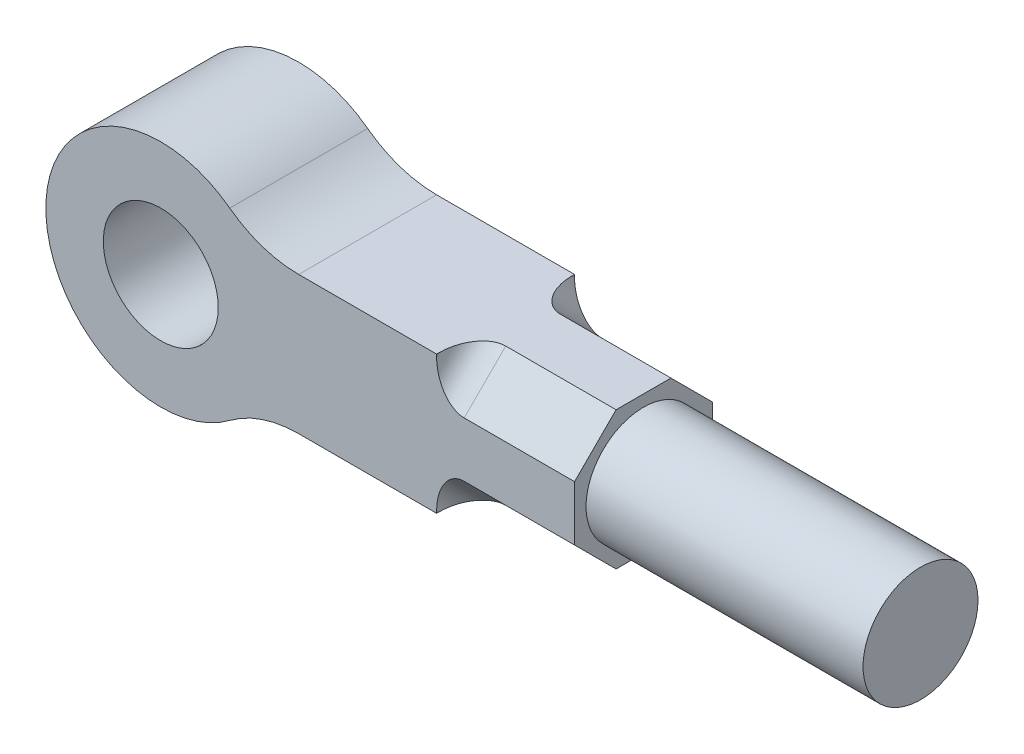
ISO-10303-21;
HEADER;
FILE_DESCRIPTION(('STEP AP214'),'2;1');
FILE_NAME('part.step','',(''),(''),'','','');
FILE_SCHEMA(('AUTOMOTIVE_DESIGN { 1 0 10303 214 1 1 1 1 }'));
ENDSEC;
DATA;
#1=APPLICATION_CONTEXT('core data for automotive mechanical design processes');
#2=APPLICATION_PROTOCOL_DEFINITION('international standard','automotive_design',2000,#1);
#3=PRODUCT_CONTEXT('',#1,'mechanical');
#4=PRODUCT('Part','Part','',(#3));
#5=PRODUCT_RELATED_PRODUCT_CATEGORY('part','',(#4));
#6=PRODUCT_DEFINITION_FORMATION('','',#4);
#7=PRODUCT_DEFINITION_CONTEXT('part definition',#1,'design');
#8=PRODUCT_DEFINITION('design','',#6,#7);
#9=PRODUCT_DEFINITION_SHAPE('','',#8);
#10=(LENGTH_UNIT() NAMED_UNIT(*) SI_UNIT(.MILLI.,.METRE.));
#11=(NAMED_UNIT(*) PLANE_ANGLE_UNIT() SI_UNIT($,.RADIAN.));
#12=(NAMED_UNIT(*) SI_UNIT($,.STERADIAN.) SOLID_ANGLE_UNIT());
#13=UNCERTAINTY_MEASURE_WITH_UNIT(LENGTH_MEASURE(1.E-05),#10,'distance_accuracy_value','');
#14=(GEOMETRIC_REPRESENTATION_CONTEXT(3) GLOBAL_UNCERTAINTY_ASSIGNED_CONTEXT((#13)) GLOBAL_UNIT_ASSIGNED_CONTEXT((#10,
#11,#12)) REPRESENTATION_CONTEXT('',''));
#15=CARTESIAN_POINT('',(0.,0.,0.));
#16=DIRECTION('',(0.,0.,1.));
#17=DIRECTION('',(1.,0.,0.));
#18=AXIS2_PLACEMENT_3D('',#15,#16,#17);
#19=CARTESIAN_POINT('',(600.,-800.,600.));
#20=DIRECTION('',(0.,0.,-1.));
#21=DIRECTION('',(-1.,0.,0.));
#22=AXIS2_PLACEMENT_3D('',#19,#20,#21);
#23=PLANE('',#22);
#24=DIRECTION('',(0.,-1.,0.));
#25=VECTOR('',#24,1.);
#26=CARTESIAN_POINT('',(1200.,0.,600.));
#27=LINE('',#26,#25);
#28=CARTESIAN_POINT('',(1200.,-289.105627484766,600.));
#29=VERTEX_POINT('',#28);
#30=CARTESIAN_POINT('',(1200.,-300.,600.));
#31=VERTEX_POINT('',#30);
#32=EDGE_CURVE('E294',#29,#31,#27,.T.);
#33=ORIENTED_EDGE('',*,*,#32,.F.);
#34=CARTESIAN_POINT('',(1320.,-289.105627484766,600.));
#35=DIRECTION('',(0.,0.,-1.));
#36=DIRECTION('',(0.,1.,0.));
#37=AXIS2_PLACEMENT_3D('',#34,#35,#36);
#38=ELLIPSE('',#37,169.705627484773,120.);
#39=CARTESIAN_POINT('',(1320.,-119.399999999994,600.));
#40=VERTEX_POINT('',#39);
#41=EDGE_CURVE('E251',#29,#40,#38,.T.);
#42=ORIENTED_EDGE('',*,*,#41,.T.);
#43=DIRECTION('',(1.,0.,0.));
#44=VECTOR('',#43,1.);
#45=CARTESIAN_POINT('',(1200.,-119.399999999994,600.));
#46=LINE('',#45,#44);
#47=CARTESIAN_POINT('',(1800.,-119.399999999994,600.));
#48=VERTEX_POINT('',#47);
#49=EDGE_CURVE('E285',#40,#48,#46,.T.);
#50=ORIENTED_EDGE('',*,*,#49,.T.);
#51=DIRECTION('',(0.,1.,0.));
#52=VECTOR('',#51,1.);
#53=CARTESIAN_POINT('',(1800.,300.,600.));
#54=LINE('',#53,#52);
#55=CARTESIAN_POINT('',(1800.,119.399999999993,600.));
#56=VERTEX_POINT('',#55);
#57=EDGE_CURVE('E338',#48,#56,#54,.T.);
#58=ORIENTED_EDGE('',*,*,#57,.T.);
#59=DIRECTION('',(1.,0.,0.));
#60=VECTOR('',#59,1.);
#61=CARTESIAN_POINT('',(1200.,119.399999999993,600.));
#62=LINE('',#61,#60);
#63=CARTESIAN_POINT('',(1320.,119.399999999993,600.));
#64=VERTEX_POINT('',#63);
#65=EDGE_CURVE('E313',#64,#56,#62,.T.);
#66=ORIENTED_EDGE('',*,*,#65,.F.);
#67=CARTESIAN_POINT('',(1320.,289.105627484763,600.));
#68=DIRECTION('',(0.,0.,-1.));
#69=DIRECTION('',(0.,1.,0.));
#70=AXIS2_PLACEMENT_3D('',#67,#68,#69);
#71=ELLIPSE('',#70,169.70562748477,120.);
#72=CARTESIAN_POINT('',(1200.,289.105627484763,600.));
#73=VERTEX_POINT('',#72);
#74=EDGE_CURVE('E11',#64,#73,#71,.T.);
#75=ORIENTED_EDGE('',*,*,#74,.T.);
#76=DIRECTION('',(0.,-1.,0.));
#77=VECTOR('',#76,1.);
#78=CARTESIAN_POINT('',(1200.,0.,600.));
#79=LINE('',#78,#77);
#80=CARTESIAN_POINT('',(1200.,300.,600.));
#81=VERTEX_POINT('',#80);
#82=EDGE_CURVE('E306',#81,#73,#79,.T.);
#83=ORIENTED_EDGE('',*,*,#82,.F.);
#84=DIRECTION('',(-1.,0.,0.));
#85=VECTOR('',#84,1.);
#86=CARTESIAN_POINT('',(600.,300.,600.));
#87=LINE('',#86,#85);
#88=CARTESIAN_POINT('',(600.,300.,600.));
#89=VERTEX_POINT('',#88);
#90=EDGE_CURVE('E342',#81,#89,#87,.T.);
#91=ORIENTED_EDGE('',*,*,#90,.T.);
#92=CARTESIAN_POINT('',(600.,800.,600.));
#93=DIRECTION('',(0.,0.,-1.));
#94=DIRECTION('',(1.,0.,0.));
#95=AXIS2_PLACEMENT_3D('',#92,#93,#94);
#96=CIRCLE('',#95,500.);
#97=CARTESIAN_POINT('',(300.,400.,600.));
#98=VERTEX_POINT('',#97);
#99=EDGE_CURVE('E345',#89,#98,#96,.T.);
#100=ORIENTED_EDGE('',*,*,#99,.T.);
#101=CARTESIAN_POINT('',(0.,0.,600.));
#102=DIRECTION('',(0.,0.,1.));
#103=DIRECTION('',(1.,0.,0.));
#104=AXIS2_PLACEMENT_3D('',#101,#102,#103);
#105=CIRCLE('',#104,500.);
#106=CARTESIAN_POINT('',(300.,-400.,600.));
#107=VERTEX_POINT('',#106);
#108=EDGE_CURVE('E348',#98,#107,#105,.T.);
#109=ORIENTED_EDGE('',*,*,#108,.T.);
#110=CARTESIAN_POINT('',(600.,-800.,600.));
#111=DIRECTION('',(0.,0.,-1.));
#112=DIRECTION('',(-1.,0.,0.));
#113=AXIS2_PLACEMENT_3D('',#110,#111,#112);
#114=CIRCLE('',#113,500.);
#115=CARTESIAN_POINT('',(600.,-300.,600.));
#116=VERTEX_POINT('',#115);
#117=EDGE_CURVE('E329',#107,#116,#114,.T.);
#118=ORIENTED_EDGE('',*,*,#117,.T.);
#119=DIRECTION('',(1.,0.,0.));
#120=VECTOR('',#119,1.);
#121=CARTESIAN_POINT('',(600.,-300.,600.));
#122=LINE('',#121,#120);
#123=EDGE_CURVE('E333',#116,#31,#122,.T.);
#124=ORIENTED_EDGE('',*,*,#123,.T.);
#125=EDGE_LOOP('',(#33,#42,#50,#58,#66,#75,#83,#91,#100,#109,#118,#124));
#126=FACE_BOUND('',#125,.T.);
#127=CARTESIAN_POINT('',(0.,0.,600.));
#128=DIRECTION('',(0.,0.,1.));
#129=DIRECTION('',(1.,0.,0.));
#130=AXIS2_PLACEMENT_3D('',#127,#128,#129);
#131=CIRCLE('',#130,250.);
#132=CARTESIAN_POINT('',(250.,0.,600.));
#133=VERTEX_POINT('',#132);
#134=EDGE_CURVE('E321',#133,#133,#131,.T.);
#135=ORIENTED_EDGE('',*,*,#134,.F.);
#136=EDGE_LOOP('',(#135));
#137=FACE_BOUND('',#136,.T.);
#138=ADVANCED_FACE('F41',(#126,#137),#23,.F.);
#139=CARTESIAN_POINT('',(600.,-800.,0.));
#140=DIRECTION('',(0.,0.,-1.));
#141=DIRECTION('',(-1.,0.,0.));
#142=AXIS2_PLACEMENT_3D('',#139,#140,#141);
#143=PLANE('',#142);
#144=DIRECTION('',(1.,0.,0.));
#145=VECTOR('',#144,1.);
#146=CARTESIAN_POINT('',(1200.,-119.400000000004,0.));
#147=LINE('',#146,#145);
#148=CARTESIAN_POINT('',(1320.,-119.400000000004,0.));
#149=VERTEX_POINT('',#148);
#150=CARTESIAN_POINT('',(1800.,-119.400000000004,0.));
#151=VERTEX_POINT('',#150);
#152=EDGE_CURVE('E281',#149,#151,#147,.T.);
#153=ORIENTED_EDGE('',*,*,#152,.F.);
#154=CARTESIAN_POINT('',(1320.,-289.105627484775,0.));
#155=DIRECTION('',(0.,0.,-1.));
#156=DIRECTION('',(0.,-1.,0.));
#157=AXIS2_PLACEMENT_3D('',#154,#155,#156);
#158=ELLIPSE('',#157,169.705627484771,120.);
#159=CARTESIAN_POINT('',(1200.,-289.105627484775,0.));
#160=VERTEX_POINT('',#159);
#161=EDGE_CURVE('E242',#149,#160,#158,.F.);
#162=ORIENTED_EDGE('',*,*,#161,.T.);
#163=DIRECTION('',(0.,1.,0.));
#164=VECTOR('',#163,1.);
#165=CARTESIAN_POINT('',(1200.,0.,0.));
#166=LINE('',#165,#164);
#167=CARTESIAN_POINT('',(1200.,-300.,0.));
#168=VERTEX_POINT('',#167);
#169=EDGE_CURVE('E273',#168,#160,#166,.T.);
#170=ORIENTED_EDGE('',*,*,#169,.F.);
#171=DIRECTION('',(1.,0.,0.));
#172=VECTOR('',#171,1.);
#173=CARTESIAN_POINT('',(600.,-300.,0.));
#174=LINE('',#173,#172);
#175=CARTESIAN_POINT('',(600.,-300.,0.));
#176=VERTEX_POINT('',#175);
#177=EDGE_CURVE('E355',#176,#168,#174,.T.);
#178=ORIENTED_EDGE('',*,*,#177,.F.);
#179=CARTESIAN_POINT('',(600.,-800.,0.));
#180=DIRECTION('',(0.,0.,-1.));
#181=DIRECTION('',(-1.,0.,0.));
#182=AXIS2_PLACEMENT_3D('',#179,#180,#181);
#183=CIRCLE('',#182,500.);
#184=CARTESIAN_POINT('',(300.,-400.,0.));
#185=VERTEX_POINT('',#184);
#186=EDGE_CURVE('E325',#185,#176,#183,.T.);
#187=ORIENTED_EDGE('',*,*,#186,.F.);
#188=CARTESIAN_POINT('',(0.,0.,0.));
#189=DIRECTION('',(0.,0.,1.));
#190=DIRECTION('',(1.,0.,0.));
#191=AXIS2_PLACEMENT_3D('',#188,#189,#190);
#192=CIRCLE('',#191,500.);
#193=CARTESIAN_POINT('',(300.,400.,0.));
#194=VERTEX_POINT('',#193);
#195=EDGE_CURVE('E334',#194,#185,#192,.T.);
#196=ORIENTED_EDGE('',*,*,#195,.F.);
#197=CARTESIAN_POINT('',(600.,800.,0.));
#198=DIRECTION('',(0.,0.,-1.));
#199=DIRECTION('',(1.,0.,0.));
#200=AXIS2_PLACEMENT_3D('',#197,#198,#199);
#201=CIRCLE('',#200,500.);
#202=CARTESIAN_POINT('',(600.,300.,0.));
#203=VERTEX_POINT('',#202);
#204=EDGE_CURVE('E364',#203,#194,#201,.T.);
#205=ORIENTED_EDGE('',*,*,#204,.F.);
#206=DIRECTION('',(-1.,0.,0.));
#207=VECTOR('',#206,1.);
#208=CARTESIAN_POINT('',(600.,300.,0.));
#209=LINE('',#208,#207);
#210=CARTESIAN_POINT('',(1200.,300.,0.));
#211=VERTEX_POINT('',#210);
#212=EDGE_CURVE('E361',#211,#203,#209,.T.);
#213=ORIENTED_EDGE('',*,*,#212,.F.);
#214=DIRECTION('',(0.,1.,0.));
#215=VECTOR('',#214,1.);
#216=CARTESIAN_POINT('',(1200.,0.,0.));
#217=LINE('',#216,#215);
#218=CARTESIAN_POINT('',(1200.,289.105627484771,0.));
#219=VERTEX_POINT('',#218);
#220=EDGE_CURVE('E177',#219,#211,#217,.T.);
#221=ORIENTED_EDGE('',*,*,#220,.F.);
#222=CARTESIAN_POINT('',(1320.,289.105627484771,0.));
#223=DIRECTION('',(0.,0.,-1.));
#224=DIRECTION('',(0.,-1.,0.));
#225=AXIS2_PLACEMENT_3D('',#222,#223,#224);
#226=ELLIPSE('',#225,169.705627484771,120.);
#227=CARTESIAN_POINT('',(1320.,119.4,0.));
#228=VERTEX_POINT('',#227);
#229=EDGE_CURVE('E245',#219,#228,#226,.F.);
#230=ORIENTED_EDGE('',*,*,#229,.T.);
#231=DIRECTION('',(1.,0.,0.));
#232=VECTOR('',#231,1.);
#233=CARTESIAN_POINT('',(1200.,119.4,0.));
#234=LINE('',#233,#232);
#235=CARTESIAN_POINT('',(1800.,119.4,0.));
#236=VERTEX_POINT('',#235);
#237=EDGE_CURVE('E176',#228,#236,#234,.T.);
#238=ORIENTED_EDGE('',*,*,#237,.T.);
#239=DIRECTION('',(0.,1.,0.));
#240=VECTOR('',#239,1.);
#241=CARTESIAN_POINT('',(1800.,300.,0.));
#242=LINE('',#241,#240);
#243=EDGE_CURVE('E187',#151,#236,#242,.T.);
#244=ORIENTED_EDGE('',*,*,#243,.F.);
#245=EDGE_LOOP('',(#153,#162,#170,#178,#187,#196,#205,#213,#221,#230,#238,#244));
#246=FACE_BOUND('',#245,.T.);
#247=CARTESIAN_POINT('',(0.,0.,0.));
#248=DIRECTION('',(0.,0.,1.));
#249=DIRECTION('',(1.,0.,0.));
#250=AXIS2_PLACEMENT_3D('',#247,#248,#249);
#251=CIRCLE('',#250,250.);
#252=CARTESIAN_POINT('',(250.,0.,0.));
#253=VERTEX_POINT('',#252);
#254=EDGE_CURVE('E318',#253,#253,#251,.T.);
#255=ORIENTED_EDGE('',*,*,#254,.T.);
#256=EDGE_LOOP('',(#255));
#257=FACE_BOUND('',#256,.T.);
#258=ADVANCED_FACE('F385',(#246,#257),#143,.T.);
#259=CARTESIAN_POINT('',(600.,-800.,600.));
#260=DIRECTION('',(0.,0.,-1.));
#261=DIRECTION('',(-1.,0.,0.));
#262=AXIS2_PLACEMENT_3D('',#259,#260,#261);
#263=CYLINDRICAL_SURFACE('',#262,500.);
#264=ORIENTED_EDGE('',*,*,#186,.T.);
#265=DIRECTION('',(0.,0.,-1.));
#266=VECTOR('',#265,1.);
#267=CARTESIAN_POINT('',(600.,-300.,600.));
#268=LINE('',#267,#266);
#269=EDGE_CURVE('E202',#116,#176,#268,.T.);
#270=ORIENTED_EDGE('',*,*,#269,.F.);
#271=ORIENTED_EDGE('',*,*,#117,.F.);
#272=DIRECTION('',(0.,0.,-1.));
#273=VECTOR('',#272,1.);
#274=CARTESIAN_POINT('',(300.,-400.,600.));
#275=LINE('',#274,#273);
#276=EDGE_CURVE('E351',#107,#185,#275,.T.);
#277=ORIENTED_EDGE('',*,*,#276,.T.);
#278=EDGE_LOOP('',(#264,#270,#271,#277));
#279=FACE_BOUND('',#278,.T.);
#280=ADVANCED_FACE('F391',(#279),#263,.F.);
#281=CARTESIAN_POINT('',(600.,-300.,600.));
#282=DIRECTION('',(0.,1.,0.));
#283=DIRECTION('',(0.,0.,1.));
#284=AXIS2_PLACEMENT_3D('',#281,#282,#283);
#285=PLANE('',#284);
#286=DIRECTION('',(0.,0.,-1.));
#287=VECTOR('',#286,1.);
#288=CARTESIAN_POINT('',(1800.,-300.,600.));
#289=LINE('',#288,#287);
#290=CARTESIAN_POINT('',(1800.,-300.,419.399999999996));
#291=VERTEX_POINT('',#290);
#292=CARTESIAN_POINT('',(1800.,-300.,180.599999999997));
#293=VERTEX_POINT('',#292);
#294=EDGE_CURVE('E196',#291,#293,#289,.T.);
#295=ORIENTED_EDGE('',*,*,#294,.F.);
#296=DIRECTION('',(1.,0.,0.));
#297=VECTOR('',#296,1.);
#298=CARTESIAN_POINT('',(1200.,-300.,419.399999999996));
#299=LINE('',#298,#297);
#300=CARTESIAN_POINT('',(1320.,-300.,419.399999999996));
#301=VERTEX_POINT('',#300);
#302=EDGE_CURVE('E298',#301,#291,#299,.T.);
#303=ORIENTED_EDGE('',*,*,#302,.F.);
#304=CARTESIAN_POINT('',(1320.,-300.,589.105627484767));
#305=DIRECTION('',(0.,1.,0.));
#306=DIRECTION('',(0.,0.,1.));
#307=AXIS2_PLACEMENT_3D('',#304,#305,#306);
#308=ELLIPSE('',#307,169.70562748477,120.);
#309=CARTESIAN_POINT('',(1200.,-300.,589.105627484767));
#310=VERTEX_POINT('',#309);
#311=EDGE_CURVE('E254',#301,#310,#308,.T.);
#312=ORIENTED_EDGE('',*,*,#311,.T.);
#313=DIRECTION('',(0.,0.,-1.));
#314=VECTOR('',#313,1.);
#315=CARTESIAN_POINT('',(1200.,-300.,0.));
#316=LINE('',#315,#314);
#317=EDGE_CURVE('E290',#31,#310,#316,.T.);
#318=ORIENTED_EDGE('',*,*,#317,.F.);
#319=ORIENTED_EDGE('',*,*,#123,.F.);
#320=ORIENTED_EDGE('',*,*,#269,.T.);
#321=ORIENTED_EDGE('',*,*,#177,.T.);
#322=DIRECTION('',(0.,0.,-1.));
#323=VECTOR('',#322,1.);
#324=CARTESIAN_POINT('',(1200.,-300.,0.));
#325=LINE('',#324,#323);
#326=CARTESIAN_POINT('',(1200.,-300.,10.8943725152251));
#327=VERTEX_POINT('',#326);
#328=EDGE_CURVE('E277',#327,#168,#325,.T.);
#329=ORIENTED_EDGE('',*,*,#328,.F.);
#330=CARTESIAN_POINT('',(1320.,-300.,10.8943725152252));
#331=DIRECTION('',(0.,1.,0.));
#332=DIRECTION('',(0.,0.,1.));
#333=AXIS2_PLACEMENT_3D('',#330,#331,#332);
#334=ELLIPSE('',#333,169.705627484772,120.);
#335=CARTESIAN_POINT('',(1320.,-300.,180.599999999997));
#336=VERTEX_POINT('',#335);
#337=EDGE_CURVE('E239',#327,#336,#334,.T.);
#338=ORIENTED_EDGE('',*,*,#337,.T.);
#339=DIRECTION('',(1.,0.,0.));
#340=VECTOR('',#339,1.);
#341=CARTESIAN_POINT('',(1200.,-300.,180.599999999997));
#342=LINE('',#341,#340);
#343=EDGE_CURVE('E190',#336,#293,#342,.T.);
#344=ORIENTED_EDGE('',*,*,#343,.T.);
#345=EDGE_LOOP('',(#295,#303,#312,#318,#319,#320,#321,#329,#338,#344));
#346=FACE_BOUND('',#345,.T.);
#347=ADVANCED_FACE('F437',(#346),#285,.F.);
#348=CARTESIAN_POINT('',(1800.,300.,600.));
#349=DIRECTION('',(-1.,0.,0.));
#350=DIRECTION('',(0.,0.,1.));
#351=AXIS2_PLACEMENT_3D('',#348,#349,#350);
#352=PLANE('',#351);
#353=CARTESIAN_POINT('',(1800.,0.,300.));
#354=DIRECTION('',(1.,0.,0.));
#355=DIRECTION('',(0.,0.,-1.));
#356=AXIS2_PLACEMENT_3D('',#353,#354,#355);
#357=CIRCLE('',#356,250.);
#358=CARTESIAN_POINT('',(1800.,0.,50.));
#359=VERTEX_POINT('',#358);
#360=EDGE_CURVE('E212',#359,#359,#357,.T.);
#361=ORIENTED_EDGE('',*,*,#360,.F.);
#362=EDGE_LOOP('',(#361));
#363=FACE_BOUND('',#362,.T.);
#364=ORIENTED_EDGE('',*,*,#57,.F.);
#365=DIRECTION('',(0.,0.707106781186552,0.707106781186543));
#366=VECTOR('',#365,1.);
#367=CARTESIAN_POINT('',(1800.,-359.699999999996,359.700000000001));
#368=LINE('',#367,#366);
#369=EDGE_CURVE('E295',#291,#48,#368,.T.);
#370=ORIENTED_EDGE('',*,*,#369,.F.);
#371=ORIENTED_EDGE('',*,*,#294,.T.);
#372=DIRECTION('',(0.,-0.707106781186545,0.70710678118655));
#373=VECTOR('',#372,1.);
#374=CARTESIAN_POINT('',(1800.,-59.7000000000025,-59.7000000000021));
#375=LINE('',#374,#373);
#376=EDGE_CURVE('E278',#151,#293,#375,.T.);
#377=ORIENTED_EDGE('',*,*,#376,.F.);
#378=ORIENTED_EDGE('',*,*,#243,.T.);
#379=DIRECTION('',(0.,-0.707106781186548,-0.707106781186548));
#380=VECTOR('',#379,1.);
#381=CARTESIAN_POINT('',(1800.,59.7,-59.7));
#382=LINE('',#381,#380);
#383=CARTESIAN_POINT('',(1800.,300.,180.6));
#384=VERTEX_POINT('',#383);
#385=EDGE_CURVE('E169',#384,#236,#382,.T.);
#386=ORIENTED_EDGE('',*,*,#385,.F.);
#387=DIRECTION('',(0.,0.,-1.));
#388=VECTOR('',#387,1.);
#389=CARTESIAN_POINT('',(1800.,300.,600.));
#390=LINE('',#389,#388);
#391=CARTESIAN_POINT('',(1800.,300.,419.399999999989));
#392=VERTEX_POINT('',#391);
#393=EDGE_CURVE('E184',#392,#384,#390,.T.);
#394=ORIENTED_EDGE('',*,*,#393,.F.);
#395=DIRECTION('',(0.,0.70710678118654,-0.707106781186555));
#396=VECTOR('',#395,1.);
#397=CARTESIAN_POINT('',(1800.,359.699999999998,359.69999999999));
#398=LINE('',#397,#396);
#399=EDGE_CURVE('E271',#56,#392,#398,.T.);
#400=ORIENTED_EDGE('',*,*,#399,.F.);
#401=EDGE_LOOP('',(#364,#370,#371,#377,#378,#386,#394,#400));
#402=FACE_BOUND('',#401,.T.);
#403=ADVANCED_FACE('F182',(#363,#402),#352,.F.);
#404=CARTESIAN_POINT('',(600.,300.,600.));
#405=DIRECTION('',(0.,-1.,0.));
#406=DIRECTION('',(0.,0.,-1.));
#407=AXIS2_PLACEMENT_3D('',#404,#405,#406);
#408=PLANE('',#407);
#409=ORIENTED_EDGE('',*,*,#393,.T.);
#410=DIRECTION('',(1.,0.,0.));
#411=VECTOR('',#410,1.);
#412=CARTESIAN_POINT('',(1200.,300.,180.6));
#413=LINE('',#412,#411);
#414=CARTESIAN_POINT('',(1320.,300.,180.6));
#415=VERTEX_POINT('',#414);
#416=EDGE_CURVE('E165',#415,#384,#413,.T.);
#417=ORIENTED_EDGE('',*,*,#416,.F.);
#418=CARTESIAN_POINT('',(1320.,300.,10.8943725152286));
#419=DIRECTION('',(0.,-1.,0.));
#420=DIRECTION('',(0.,0.,-1.));
#421=AXIS2_PLACEMENT_3D('',#418,#419,#420);
#422=ELLIPSE('',#421,169.705627484771,120.);
#423=CARTESIAN_POINT('',(1200.,300.,10.8943725152286));
#424=VERTEX_POINT('',#423);
#425=EDGE_CURVE('E248',#415,#424,#422,.T.);
#426=ORIENTED_EDGE('',*,*,#425,.T.);
#427=DIRECTION('',(0.,0.,1.));
#428=VECTOR('',#427,1.);
#429=CARTESIAN_POINT('',(1200.,300.,0.));
#430=LINE('',#429,#428);
#431=EDGE_CURVE('E189',#211,#424,#430,.T.);
#432=ORIENTED_EDGE('',*,*,#431,.F.);
#433=ORIENTED_EDGE('',*,*,#212,.T.);
#434=DIRECTION('',(0.,0.,-1.));
#435=VECTOR('',#434,1.);
#436=CARTESIAN_POINT('',(600.,300.,600.));
#437=LINE('',#436,#435);
#438=EDGE_CURVE('E197',#89,#203,#437,.T.);
#439=ORIENTED_EDGE('',*,*,#438,.F.);
#440=ORIENTED_EDGE('',*,*,#90,.F.);
#441=DIRECTION('',(0.,0.,1.));
#442=VECTOR('',#441,1.);
#443=CARTESIAN_POINT('',(1200.,300.,0.));
#444=LINE('',#443,#442);
#445=CARTESIAN_POINT('',(1200.,300.,589.105627484763));
#446=VERTEX_POINT('',#445);
#447=EDGE_CURVE('E310',#446,#81,#444,.T.);
#448=ORIENTED_EDGE('',*,*,#447,.F.);
#449=CARTESIAN_POINT('',(1320.,300.,589.105627484763));
#450=DIRECTION('',(0.,-1.,0.));
#451=DIRECTION('',(0.,0.,-1.));
#452=AXIS2_PLACEMENT_3D('',#449,#450,#451);
#453=ELLIPSE('',#452,169.705627484773,120.);
#454=CARTESIAN_POINT('',(1320.,300.,419.399999999989));
#455=VERTEX_POINT('',#454);
#456=EDGE_CURVE('E50',#446,#455,#453,.T.);
#457=ORIENTED_EDGE('',*,*,#456,.T.);
#458=DIRECTION('',(1.,0.,0.));
#459=VECTOR('',#458,1.);
#460=CARTESIAN_POINT('',(1200.,300.,419.399999999989));
#461=LINE('',#460,#459);
#462=EDGE_CURVE('E193',#455,#392,#461,.T.);
#463=ORIENTED_EDGE('',*,*,#462,.T.);
#464=EDGE_LOOP('',(#409,#417,#426,#432,#433,#439,#440,#448,#457,#463));
#465=FACE_BOUND('',#464,.T.);
#466=ADVANCED_FACE('F192',(#465),#408,.F.);
#467=CARTESIAN_POINT('',(600.,800.,600.));
#468=DIRECTION('',(0.,0.,-1.));
#469=DIRECTION('',(-1.,0.,0.));
#470=AXIS2_PLACEMENT_3D('',#467,#468,#469);
#471=CYLINDRICAL_SURFACE('',#470,500.);
#472=ORIENTED_EDGE('',*,*,#204,.T.);
#473=DIRECTION('',(0.,0.,-1.));
#474=VECTOR('',#473,1.);
#475=CARTESIAN_POINT('',(300.,400.,600.));
#476=LINE('',#475,#474);
#477=EDGE_CURVE('E205',#98,#194,#476,.T.);
#478=ORIENTED_EDGE('',*,*,#477,.F.);
#479=ORIENTED_EDGE('',*,*,#99,.F.);
#480=ORIENTED_EDGE('',*,*,#438,.T.);
#481=EDGE_LOOP('',(#472,#478,#479,#480));
#482=FACE_BOUND('',#481,.T.);
#483=ADVANCED_FACE('F399',(#482),#471,.F.);
#484=CARTESIAN_POINT('',(0.,0.,600.));
#485=DIRECTION('',(0.,0.,-1.));
#486=DIRECTION('',(-1.,0.,0.));
#487=AXIS2_PLACEMENT_3D('',#484,#485,#486);
#488=CYLINDRICAL_SURFACE('',#487,500.);
#489=ORIENTED_EDGE('',*,*,#195,.T.);
#490=ORIENTED_EDGE('',*,*,#276,.F.);
#491=ORIENTED_EDGE('',*,*,#108,.F.);
#492=ORIENTED_EDGE('',*,*,#477,.T.);
#493=EDGE_LOOP('',(#489,#490,#491,#492));
#494=FACE_BOUND('',#493,.T.);
#495=ADVANCED_FACE('F377',(#494),#488,.T.);
#496=CARTESIAN_POINT('',(0.,0.,600.));
#497=DIRECTION('',(0.,0.,-1.));
#498=DIRECTION('',(-1.,0.,0.));
#499=AXIS2_PLACEMENT_3D('',#496,#497,#498);
#500=CYLINDRICAL_SURFACE('',#499,250.);
#501=ORIENTED_EDGE('',*,*,#134,.T.);
#502=EDGE_LOOP('',(#501));
#503=FACE_BOUND('',#502,.T.);
#504=ORIENTED_EDGE('',*,*,#254,.F.);
#505=EDGE_LOOP('',(#504));
#506=FACE_BOUND('',#505,.T.);
#507=ADVANCED_FACE('F426',(#503,#506),#500,.F.);
#508=CARTESIAN_POINT('',(1200.,359.699999999998,359.69999999999));
#509=DIRECTION('',(0.,-0.707106781186555,-0.70710678118654));
#510=DIRECTION('',(0.,0.70710678118654,-0.707106781186555));
#511=AXIS2_PLACEMENT_3D('',#508,#509,#510);
#512=PLANE('',#511);
#513=ORIENTED_EDGE('',*,*,#462,.F.);
#514=DIRECTION('',(0.,0.70710678118654,-0.707106781186555));
#515=VECTOR('',#514,1.);
#516=CARTESIAN_POINT('',(1320.,359.699999999998,359.69999999999));
#517=LINE('',#516,#515);
#518=EDGE_CURVE('E57',#455,#64,#517,.F.);
#519=ORIENTED_EDGE('',*,*,#518,.T.);
#520=ORIENTED_EDGE('',*,*,#65,.T.);
#521=ORIENTED_EDGE('',*,*,#399,.T.);
#522=EDGE_LOOP('',(#513,#519,#520,#521));
#523=FACE_BOUND('',#522,.T.);
#524=ADVANCED_FACE('F475',(#523),#512,.F.);
#525=CARTESIAN_POINT('',(1200.,0.,0.));
#526=DIRECTION('',(1.,0.,0.));
#527=DIRECTION('',(0.,0.,-1.));
#528=AXIS2_PLACEMENT_3D('',#525,#526,#527);
#529=PLANE('',#528);
#530=ORIENTED_EDGE('',*,*,#82,.T.);
#531=DIRECTION('',(0.,0.70710678118654,-0.707106781186555));
#532=VECTOR('',#531,1.);
#533=CARTESIAN_POINT('',(1200.,444.552813742385,444.552813742375));
#534=LINE('',#533,#532);
#535=EDGE_CURVE('E233',#73,#446,#534,.T.);
#536=ORIENTED_EDGE('',*,*,#535,.T.);
#537=ORIENTED_EDGE('',*,*,#447,.T.);
#538=EDGE_LOOP('',(#530,#536,#537));
#539=FACE_BOUND('',#538,.T.);
#540=ADVANCED_FACE('F481',(#539),#529,.T.);
#541=CARTESIAN_POINT('',(1200.,59.7,-59.7));
#542=DIRECTION('',(0.,-0.707106781186548,0.707106781186548));
#543=DIRECTION('',(0.,-0.707106781186548,-0.707106781186548));
#544=AXIS2_PLACEMENT_3D('',#541,#542,#543);
#545=PLANE('',#544);
#546=ORIENTED_EDGE('',*,*,#237,.F.);
#547=DIRECTION('',(0.,-0.707106781186548,-0.707106781186548));
#548=VECTOR('',#547,1.);
#549=CARTESIAN_POINT('',(1320.,59.7,-59.7));
#550=LINE('',#549,#548);
#551=EDGE_CURVE('E172',#228,#415,#550,.F.);
#552=ORIENTED_EDGE('',*,*,#551,.T.);
#553=ORIENTED_EDGE('',*,*,#416,.T.);
#554=ORIENTED_EDGE('',*,*,#385,.T.);
#555=EDGE_LOOP('',(#546,#552,#553,#554));
#556=FACE_BOUND('',#555,.T.);
#557=ADVANCED_FACE('F168',(#556),#545,.F.);
#558=CARTESIAN_POINT('',(1200.,0.,0.));
#559=DIRECTION('',(1.,0.,0.));
#560=DIRECTION('',(0.,0.,-1.));
#561=AXIS2_PLACEMENT_3D('',#558,#559,#560);
#562=PLANE('',#561);
#563=ORIENTED_EDGE('',*,*,#431,.T.);
#564=DIRECTION('',(0.,-0.707106781186548,-0.707106781186548));
#565=VECTOR('',#564,1.);
#566=CARTESIAN_POINT('',(1200.,144.552813742386,-144.552813742386));
#567=LINE('',#566,#565);
#568=EDGE_CURVE('E220',#424,#219,#567,.T.);
#569=ORIENTED_EDGE('',*,*,#568,.T.);
#570=ORIENTED_EDGE('',*,*,#220,.T.);
#571=EDGE_LOOP('',(#563,#569,#570));
#572=FACE_BOUND('',#571,.T.);
#573=ADVANCED_FACE('F403',(#572),#562,.T.);
#574=CARTESIAN_POINT('',(1200.,-59.7000000000025,-59.7000000000021));
#575=DIRECTION('',(0.,0.70710678118655,0.707106781186545));
#576=DIRECTION('',(0.,-0.707106781186545,0.70710678118655));
#577=AXIS2_PLACEMENT_3D('',#574,#575,#576);
#578=PLANE('',#577);
#579=ORIENTED_EDGE('',*,*,#343,.F.);
#580=DIRECTION('',(0.,-0.707106781186545,0.70710678118655));
#581=VECTOR('',#580,1.);
#582=CARTESIAN_POINT('',(1320.,-59.7000000000025,-59.7000000000021));
#583=LINE('',#582,#581);
#584=EDGE_CURVE('E217',#336,#149,#583,.F.);
#585=ORIENTED_EDGE('',*,*,#584,.T.);
#586=ORIENTED_EDGE('',*,*,#152,.T.);
#587=ORIENTED_EDGE('',*,*,#376,.T.);
#588=EDGE_LOOP('',(#579,#585,#586,#587));
#589=FACE_BOUND('',#588,.T.);
#590=ADVANCED_FACE('F500',(#589),#578,.F.);
#591=CARTESIAN_POINT('',(1200.,0.,0.));
#592=DIRECTION('',(1.,0.,0.));
#593=DIRECTION('',(0.,0.,-1.));
#594=AXIS2_PLACEMENT_3D('',#591,#592,#593);
#595=PLANE('',#594);
#596=ORIENTED_EDGE('',*,*,#169,.T.);
#597=DIRECTION('',(0.,-0.707106781186545,0.70710678118655));
#598=VECTOR('',#597,1.);
#599=CARTESIAN_POINT('',(1200.,-144.552813742388,-144.552813742387));
#600=LINE('',#599,#598);
#601=EDGE_CURVE('E213',#160,#327,#600,.T.);
#602=ORIENTED_EDGE('',*,*,#601,.T.);
#603=ORIENTED_EDGE('',*,*,#328,.T.);
#604=EDGE_LOOP('',(#596,#602,#603));
#605=FACE_BOUND('',#604,.T.);
#606=ADVANCED_FACE('F507',(#605),#595,.T.);
#607=CARTESIAN_POINT('',(1200.,-359.699999999996,359.700000000001));
#608=DIRECTION('',(0.,0.707106781186543,-0.707106781186552));
#609=DIRECTION('',(0.,0.707106781186552,0.707106781186543));
#610=AXIS2_PLACEMENT_3D('',#607,#608,#609);
#611=PLANE('',#610);
#612=ORIENTED_EDGE('',*,*,#49,.F.);
#613=DIRECTION('',(0.,0.707106781186552,0.707106781186543));
#614=VECTOR('',#613,1.);
#615=CARTESIAN_POINT('',(1320.,-359.699999999996,359.700000000001));
#616=LINE('',#615,#614);
#617=EDGE_CURVE('E230',#40,#301,#616,.F.);
#618=ORIENTED_EDGE('',*,*,#617,.T.);
#619=ORIENTED_EDGE('',*,*,#302,.T.);
#620=ORIENTED_EDGE('',*,*,#369,.T.);
#621=EDGE_LOOP('',(#612,#618,#619,#620));
#622=FACE_BOUND('',#621,.T.);
#623=ADVANCED_FACE('F515',(#622),#611,.F.);
#624=CARTESIAN_POINT('',(1200.,0.,0.));
#625=DIRECTION('',(1.,0.,0.));
#626=DIRECTION('',(0.,0.,-1.));
#627=AXIS2_PLACEMENT_3D('',#624,#625,#626);
#628=PLANE('',#627);
#629=ORIENTED_EDGE('',*,*,#317,.T.);
#630=DIRECTION('',(0.,0.707106781186552,0.707106781186543));
#631=VECTOR('',#630,1.);
#632=CARTESIAN_POINT('',(1200.,-444.552813742381,444.552813742387));
#633=LINE('',#632,#631);
#634=EDGE_CURVE('E226',#310,#29,#633,.T.);
#635=ORIENTED_EDGE('',*,*,#634,.T.);
#636=ORIENTED_EDGE('',*,*,#32,.T.);
#637=EDGE_LOOP('',(#629,#635,#636));
#638=FACE_BOUND('',#637,.T.);
#639=ADVANCED_FACE('F523',(#638),#628,.T.);
#640=CARTESIAN_POINT('',(3005.,0.,300.));
#641=DIRECTION('',(-1.,0.,0.));
#642=DIRECTION('',(0.,0.,1.));
#643=AXIS2_PLACEMENT_3D('',#640,#641,#642);
#644=CYLINDRICAL_SURFACE('',#643,250.);
#645=CARTESIAN_POINT('',(3005.,0.,300.));
#646=DIRECTION('',(1.,0.,0.));
#647=DIRECTION('',(0.,0.,-1.));
#648=AXIS2_PLACEMENT_3D('',#645,#646,#647);
#649=CIRCLE('',#648,250.);
#650=CARTESIAN_POINT('',(3005.,0.,50.));
#651=VERTEX_POINT('',#650);
#652=EDGE_CURVE('E264',#651,#651,#649,.T.);
#653=ORIENTED_EDGE('',*,*,#652,.F.);
#654=EDGE_LOOP('',(#653));
#655=FACE_BOUND('',#654,.T.);
#656=ORIENTED_EDGE('',*,*,#360,.T.);
#657=EDGE_LOOP('',(#656));
#658=FACE_BOUND('',#657,.T.);
#659=ADVANCED_FACE('F531',(#655,#658),#644,.T.);
#660=CARTESIAN_POINT('',(3005.,0.,0.));
#661=DIRECTION('',(1.,0.,0.));
#662=DIRECTION('',(0.,0.,-1.));
#663=AXIS2_PLACEMENT_3D('',#660,#661,#662);
#664=PLANE('',#663);
#665=ORIENTED_EDGE('',*,*,#652,.T.);
#666=EDGE_LOOP('',(#665));
#667=FACE_BOUND('',#666,.T.);
#668=ADVANCED_FACE('F416',(#667),#664,.T.);
#669=CARTESIAN_POINT('',(1320.,-144.552813742388,-144.552813742387));
#670=DIRECTION('',(0.,-0.707106781186545,0.70710678118655));
#671=DIRECTION('',(0.,-0.70710678118655,-0.707106781186545));
#672=AXIS2_PLACEMENT_3D('',#669,#670,#671);
#673=CYLINDRICAL_SURFACE('',#672,120.);
#674=ORIENTED_EDGE('',*,*,#161,.F.);
#675=ORIENTED_EDGE('',*,*,#584,.F.);
#676=ORIENTED_EDGE('',*,*,#337,.F.);
#677=ORIENTED_EDGE('',*,*,#601,.F.);
#678=EDGE_LOOP('',(#674,#675,#676,#677));
#679=FACE_BOUND('',#678,.T.);
#680=ADVANCED_FACE('F409',(#679),#673,.F.);
#681=CARTESIAN_POINT('',(1320.,144.552813742386,-144.552813742386));
#682=DIRECTION('',(0.,-0.707106781186548,-0.707106781186548));
#683=DIRECTION('',(0.,0.707106781186548,-0.707106781186548));
#684=AXIS2_PLACEMENT_3D('',#681,#682,#683);
#685=CYLINDRICAL_SURFACE('',#684,120.);
#686=ORIENTED_EDGE('',*,*,#425,.F.);
#687=ORIENTED_EDGE('',*,*,#551,.F.);
#688=ORIENTED_EDGE('',*,*,#229,.F.);
#689=ORIENTED_EDGE('',*,*,#568,.F.);
#690=EDGE_LOOP('',(#686,#687,#688,#689));
#691=FACE_BOUND('',#690,.T.);
#692=ADVANCED_FACE('F406',(#691),#685,.F.);
#693=CARTESIAN_POINT('',(1320.,-444.552813742381,444.552813742387));
#694=DIRECTION('',(0.,0.707106781186552,0.707106781186543));
#695=DIRECTION('',(0.,-0.707106781186543,0.707106781186552));
#696=AXIS2_PLACEMENT_3D('',#693,#694,#695);
#697=CYLINDRICAL_SURFACE('',#696,120.);
#698=ORIENTED_EDGE('',*,*,#311,.F.);
#699=ORIENTED_EDGE('',*,*,#617,.F.);
#700=ORIENTED_EDGE('',*,*,#41,.F.);
#701=ORIENTED_EDGE('',*,*,#634,.F.);
#702=EDGE_LOOP('',(#698,#699,#700,#701));
#703=FACE_BOUND('',#702,.T.);
#704=ADVANCED_FACE('F408',(#703),#697,.F.);
#705=CARTESIAN_POINT('',(1320.,444.552813742385,444.552813742375));
#706=DIRECTION('',(0.,0.70710678118654,-0.707106781186555));
#707=DIRECTION('',(0.,0.707106781186555,0.70710678118654));
#708=AXIS2_PLACEMENT_3D('',#705,#706,#707);
#709=CYLINDRICAL_SURFACE('',#708,120.);
#710=ORIENTED_EDGE('',*,*,#74,.F.);
#711=ORIENTED_EDGE('',*,*,#518,.F.);
#712=ORIENTED_EDGE('',*,*,#456,.F.);
#713=ORIENTED_EDGE('',*,*,#535,.F.);
#714=EDGE_LOOP('',(#710,#711,#712,#713));
#715=FACE_BOUND('',#714,.T.);
#716=ADVANCED_FACE('F43',(#715),#709,.F.);
#717=CLOSED_SHELL('',(#138,#258,#280,#347,#403,#466,#483,#495,#507,#524,#540,#557,#573,#590,
#606,#623,#639,#659,#668,#680,#692,#704,#716));
#718=MANIFOLD_SOLID_BREP('B2',#717);
#719=ADVANCED_BREP_SHAPE_REPRESENTATION('',(#18,#718),#14);
#720=SHAPE_DEFINITION_REPRESENTATION(#9,#719);
ENDSEC;
END-ISO-10303-21;
